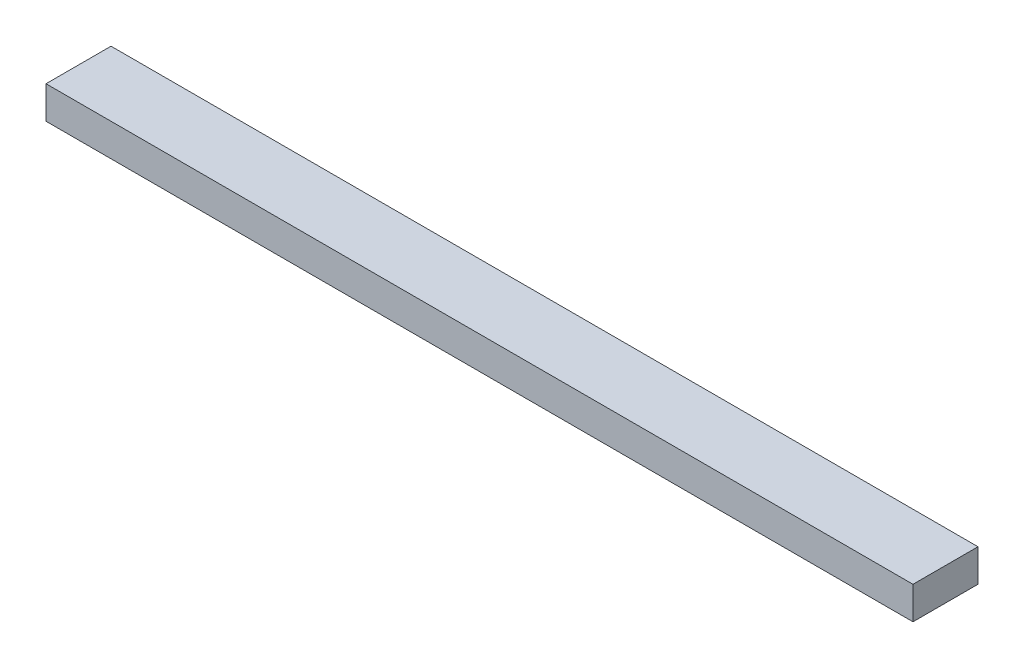
ISO-10303-21;
HEADER;
FILE_DESCRIPTION(('STEP AP214'),'2;1');
FILE_NAME('part.step','',(''),(''),'','','');
FILE_SCHEMA(('AUTOMOTIVE_DESIGN { 1 0 10303 214 1 1 1 1 }'));
ENDSEC;
DATA;
#1=APPLICATION_CONTEXT('core data for automotive mechanical design processes');
#2=APPLICATION_PROTOCOL_DEFINITION('international standard','automotive_design',2000,#1);
#3=PRODUCT_CONTEXT('',#1,'mechanical');
#4=PRODUCT('Part','Part','',(#3));
#5=PRODUCT_RELATED_PRODUCT_CATEGORY('part','',(#4));
#6=PRODUCT_DEFINITION_FORMATION('','',#4);
#7=PRODUCT_DEFINITION_CONTEXT('part definition',#1,'design');
#8=PRODUCT_DEFINITION('design','',#6,#7);
#9=PRODUCT_DEFINITION_SHAPE('','',#8);
#10=(LENGTH_UNIT() NAMED_UNIT(*) SI_UNIT(.MILLI.,.METRE.));
#11=(NAMED_UNIT(*) PLANE_ANGLE_UNIT() SI_UNIT($,.RADIAN.));
#12=(NAMED_UNIT(*) SI_UNIT($,.STERADIAN.) SOLID_ANGLE_UNIT());
#13=UNCERTAINTY_MEASURE_WITH_UNIT(LENGTH_MEASURE(1.E-05),#10,'distance_accuracy_value','');
#14=(GEOMETRIC_REPRESENTATION_CONTEXT(3) GLOBAL_UNCERTAINTY_ASSIGNED_CONTEXT((#13)) GLOBAL_UNIT_ASSIGNED_CONTEXT((#10,
#11,#12)) REPRESENTATION_CONTEXT('',''));
#15=CARTESIAN_POINT('',(0.,0.,0.));
#16=DIRECTION('',(0.,0.,1.));
#17=DIRECTION('',(1.,0.,0.));
#18=AXIS2_PLACEMENT_3D('',#15,#16,#17);
#19=CARTESIAN_POINT('',(0.,19.05,0.));
#20=DIRECTION('',(1.,0.,0.));
#21=DIRECTION('',(0.,0.,-1.));
#22=AXIS2_PLACEMENT_3D('',#19,#20,#21);
#23=PLANE('',#22);
#24=DIRECTION('',(0.,0.,1.));
#25=VECTOR('',#24,1.);
#26=CARTESIAN_POINT('',(0.,0.,0.));
#27=LINE('',#26,#25);
#28=CARTESIAN_POINT('',(0.,0.,-38.1));
#29=VERTEX_POINT('',#28);
#30=CARTESIAN_POINT('',(0.,0.,0.));
#31=VERTEX_POINT('',#30);
#32=EDGE_CURVE('E102',#29,#31,#27,.T.);
#33=ORIENTED_EDGE('',*,*,#32,.T.);
#34=DIRECTION('',(0.,-1.,0.));
#35=VECTOR('',#34,1.);
#36=CARTESIAN_POINT('',(0.,19.05,0.));
#37=LINE('',#36,#35);
#38=CARTESIAN_POINT('',(0.,19.05,0.));
#39=VERTEX_POINT('',#38);
#40=EDGE_CURVE('E11',#39,#31,#37,.T.);
#41=ORIENTED_EDGE('',*,*,#40,.F.);
#42=DIRECTION('',(0.,0.,1.));
#43=VECTOR('',#42,1.);
#44=CARTESIAN_POINT('',(0.,19.05,0.));
#45=LINE('',#44,#43);
#46=CARTESIAN_POINT('',(0.,19.05,-38.1));
#47=VERTEX_POINT('',#46);
#48=EDGE_CURVE('E90',#47,#39,#45,.T.);
#49=ORIENTED_EDGE('',*,*,#48,.F.);
#50=DIRECTION('',(0.,-1.,0.));
#51=VECTOR('',#50,1.);
#52=CARTESIAN_POINT('',(0.,19.05,-38.1));
#53=LINE('',#52,#51);
#54=EDGE_CURVE('E98',#47,#29,#53,.T.);
#55=ORIENTED_EDGE('',*,*,#54,.T.);
#56=EDGE_LOOP('',(#33,#41,#49,#55));
#57=FACE_BOUND('',#56,.T.);
#58=ADVANCED_FACE('F39',(#57),#23,.F.);
#59=CARTESIAN_POINT('',(0.,19.05,0.));
#60=DIRECTION('',(0.,0.,-1.));
#61=DIRECTION('',(-1.,0.,0.));
#62=AXIS2_PLACEMENT_3D('',#59,#60,#61);
#63=PLANE('',#62);
#64=DIRECTION('',(1.,0.,0.));
#65=VECTOR('',#64,1.);
#66=CARTESIAN_POINT('',(0.,0.,0.));
#67=LINE('',#66,#65);
#68=CARTESIAN_POINT('',(508.,0.,0.));
#69=VERTEX_POINT('',#68);
#70=EDGE_CURVE('E94',#31,#69,#67,.T.);
#71=ORIENTED_EDGE('',*,*,#70,.T.);
#72=DIRECTION('',(0.,-1.,0.));
#73=VECTOR('',#72,1.);
#74=CARTESIAN_POINT('',(508.,19.05,0.));
#75=LINE('',#74,#73);
#76=CARTESIAN_POINT('',(508.,19.05,0.));
#77=VERTEX_POINT('',#76);
#78=EDGE_CURVE('E47',#77,#69,#75,.T.);
#79=ORIENTED_EDGE('',*,*,#78,.F.);
#80=DIRECTION('',(1.,0.,0.));
#81=VECTOR('',#80,1.);
#82=CARTESIAN_POINT('',(0.,19.05,0.));
#83=LINE('',#82,#81);
#84=EDGE_CURVE('E85',#39,#77,#83,.T.);
#85=ORIENTED_EDGE('',*,*,#84,.F.);
#86=ORIENTED_EDGE('',*,*,#40,.T.);
#87=EDGE_LOOP('',(#71,#79,#85,#86));
#88=FACE_BOUND('',#87,.T.);
#89=ADVANCED_FACE('F93',(#88),#63,.F.);
#90=CARTESIAN_POINT('',(508.,19.05,0.));
#91=DIRECTION('',(-1.,0.,0.));
#92=DIRECTION('',(0.,0.,1.));
#93=AXIS2_PLACEMENT_3D('',#90,#91,#92);
#94=PLANE('',#93);
#95=DIRECTION('',(0.,0.,-1.));
#96=VECTOR('',#95,1.);
#97=CARTESIAN_POINT('',(508.,0.,0.));
#98=LINE('',#97,#96);
#99=CARTESIAN_POINT('',(508.,0.,-38.1));
#100=VERTEX_POINT('',#99);
#101=EDGE_CURVE('E72',#69,#100,#98,.T.);
#102=ORIENTED_EDGE('',*,*,#101,.T.);
#103=DIRECTION('',(0.,-1.,0.));
#104=VECTOR('',#103,1.);
#105=CARTESIAN_POINT('',(508.,19.05,-38.1));
#106=LINE('',#105,#104);
#107=CARTESIAN_POINT('',(508.,19.05,-38.1));
#108=VERTEX_POINT('',#107);
#109=EDGE_CURVE('E95',#108,#100,#106,.T.);
#110=ORIENTED_EDGE('',*,*,#109,.F.);
#111=DIRECTION('',(0.,0.,-1.));
#112=VECTOR('',#111,1.);
#113=CARTESIAN_POINT('',(508.,19.05,0.));
#114=LINE('',#113,#112);
#115=EDGE_CURVE('E88',#77,#108,#114,.T.);
#116=ORIENTED_EDGE('',*,*,#115,.F.);
#117=ORIENTED_EDGE('',*,*,#78,.T.);
#118=EDGE_LOOP('',(#102,#110,#116,#117));
#119=FACE_BOUND('',#118,.T.);
#120=ADVANCED_FACE('F96',(#119),#94,.F.);
#121=CARTESIAN_POINT('',(0.,19.05,-38.1));
#122=DIRECTION('',(0.,0.,1.));
#123=DIRECTION('',(1.,0.,0.));
#124=AXIS2_PLACEMENT_3D('',#121,#122,#123);
#125=PLANE('',#124);
#126=DIRECTION('',(-1.,0.,0.));
#127=VECTOR('',#126,1.);
#128=CARTESIAN_POINT('',(0.,0.,-38.1));
#129=LINE('',#128,#127);
#130=EDGE_CURVE('E78',#100,#29,#129,.T.);
#131=ORIENTED_EDGE('',*,*,#130,.T.);
#132=ORIENTED_EDGE('',*,*,#54,.F.);
#133=DIRECTION('',(-1.,0.,0.));
#134=VECTOR('',#133,1.);
#135=CARTESIAN_POINT('',(0.,19.05,-38.1));
#136=LINE('',#135,#134);
#137=EDGE_CURVE('E55',#108,#47,#136,.T.);
#138=ORIENTED_EDGE('',*,*,#137,.F.);
#139=ORIENTED_EDGE('',*,*,#109,.T.);
#140=EDGE_LOOP('',(#131,#132,#138,#139));
#141=FACE_BOUND('',#140,.T.);
#142=ADVANCED_FACE('F109',(#141),#125,.F.);
#143=CARTESIAN_POINT('',(0.,19.05,0.));
#144=DIRECTION('',(0.,-1.,0.));
#145=DIRECTION('',(0.,0.,-1.));
#146=AXIS2_PLACEMENT_3D('',#143,#144,#145);
#147=PLANE('',#146);
#148=ORIENTED_EDGE('',*,*,#48,.T.);
#149=ORIENTED_EDGE('',*,*,#84,.T.);
#150=ORIENTED_EDGE('',*,*,#115,.T.);
#151=ORIENTED_EDGE('',*,*,#137,.T.);
#152=EDGE_LOOP('',(#148,#149,#150,#151));
#153=FACE_BOUND('',#152,.T.);
#154=ADVANCED_FACE('F86',(#153),#147,.F.);
#155=CARTESIAN_POINT('',(0.,0.,0.));
#156=DIRECTION('',(0.,-1.,0.));
#157=DIRECTION('',(0.,0.,-1.));
#158=AXIS2_PLACEMENT_3D('',#155,#156,#157);
#159=PLANE('',#158);
#160=ORIENTED_EDGE('',*,*,#32,.F.);
#161=ORIENTED_EDGE('',*,*,#130,.F.);
#162=ORIENTED_EDGE('',*,*,#101,.F.);
#163=ORIENTED_EDGE('',*,*,#70,.F.);
#164=EDGE_LOOP('',(#160,#161,#162,#163));
#165=FACE_BOUND('',#164,.T.);
#166=ADVANCED_FACE('F112',(#165),#159,.T.);
#167=CLOSED_SHELL('',(#58,#89,#120,#142,#154,#166));
#168=MANIFOLD_SOLID_BREP('B2',#167);
#169=ADVANCED_BREP_SHAPE_REPRESENTATION('',(#18,#168),#14);
#170=SHAPE_DEFINITION_REPRESENTATION(#9,#169);
ENDSEC;
END-ISO-10303-21;
